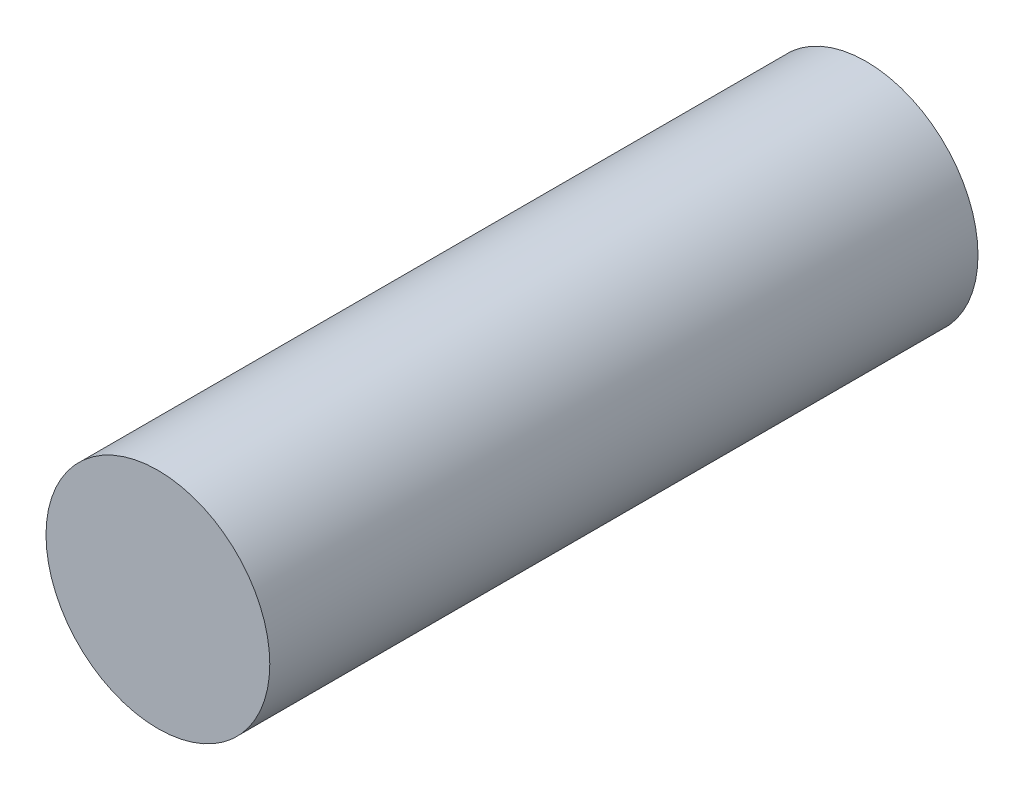
ISO-10303-21;
HEADER;
FILE_DESCRIPTION(('STEP AP214'),'2;1');
FILE_NAME('part.step','',(''),(''),'','','');
FILE_SCHEMA(('AUTOMOTIVE_DESIGN { 1 0 10303 214 1 1 1 1 }'));
ENDSEC;
DATA;
#1=APPLICATION_CONTEXT('core data for automotive mechanical design processes');
#2=APPLICATION_PROTOCOL_DEFINITION('international standard','automotive_design',2000,#1);
#3=PRODUCT_CONTEXT('',#1,'mechanical');
#4=PRODUCT('Part','Part','',(#3));
#5=PRODUCT_RELATED_PRODUCT_CATEGORY('part','',(#4));
#6=PRODUCT_DEFINITION_FORMATION('','',#4);
#7=PRODUCT_DEFINITION_CONTEXT('part definition',#1,'design');
#8=PRODUCT_DEFINITION('design','',#6,#7);
#9=PRODUCT_DEFINITION_SHAPE('','',#8);
#10=(LENGTH_UNIT() NAMED_UNIT(*) SI_UNIT(.MILLI.,.METRE.));
#11=(NAMED_UNIT(*) PLANE_ANGLE_UNIT() SI_UNIT($,.RADIAN.));
#12=(NAMED_UNIT(*) SI_UNIT($,.STERADIAN.) SOLID_ANGLE_UNIT());
#13=UNCERTAINTY_MEASURE_WITH_UNIT(LENGTH_MEASURE(1.E-05),#10,'distance_accuracy_value','');
#14=(GEOMETRIC_REPRESENTATION_CONTEXT(3) GLOBAL_UNCERTAINTY_ASSIGNED_CONTEXT((#13)) GLOBAL_UNIT_ASSIGNED_CONTEXT((#10,
#11,#12)) REPRESENTATION_CONTEXT('',''));
#15=CARTESIAN_POINT('',(0.,0.,0.));
#16=DIRECTION('',(0.,0.,1.));
#17=DIRECTION('',(1.,0.,0.));
#18=AXIS2_PLACEMENT_3D('',#15,#16,#17);
#19=CARTESIAN_POINT('',(0.,0.,50.));
#20=DIRECTION('',(0.,0.,-1.));
#21=DIRECTION('',(-1.,0.,0.));
#22=AXIS2_PLACEMENT_3D('',#19,#20,#21);
#23=CYLINDRICAL_SURFACE('',#22,7.9);
#24=CARTESIAN_POINT('',(0.,0.,50.));
#25=DIRECTION('',(0.,0.,1.));
#26=DIRECTION('',(1.,0.,0.));
#27=AXIS2_PLACEMENT_3D('',#24,#25,#26);
#28=CIRCLE('',#27,7.9);
#29=CARTESIAN_POINT('',(7.9,0.,50.));
#30=VERTEX_POINT('',#29);
#31=EDGE_CURVE('E10',#30,#30,#28,.T.);
#32=ORIENTED_EDGE('',*,*,#31,.F.);
#33=EDGE_LOOP('',(#32));
#34=FACE_BOUND('',#33,.T.);
#35=CARTESIAN_POINT('',(0.,0.,0.));
#36=DIRECTION('',(0.,0.,1.));
#37=DIRECTION('',(1.,0.,0.));
#38=AXIS2_PLACEMENT_3D('',#35,#36,#37);
#39=CIRCLE('',#38,7.9);
#40=CARTESIAN_POINT('',(7.9,0.,0.));
#41=VERTEX_POINT('',#40);
#42=EDGE_CURVE('E34',#41,#41,#39,.T.);
#43=ORIENTED_EDGE('',*,*,#42,.T.);
#44=EDGE_LOOP('',(#43));
#45=FACE_BOUND('',#44,.T.);
#46=ADVANCED_FACE('F31',(#34,#45),#23,.T.);
#47=CARTESIAN_POINT('',(0.,0.,50.));
#48=DIRECTION('',(0.,0.,1.));
#49=DIRECTION('',(1.,0.,0.));
#50=AXIS2_PLACEMENT_3D('',#47,#48,#49);
#51=PLANE('',#50);
#52=ORIENTED_EDGE('',*,*,#31,.T.);
#53=EDGE_LOOP('',(#52));
#54=FACE_BOUND('',#53,.T.);
#55=ADVANCED_FACE('F46',(#54),#51,.T.);
#56=CARTESIAN_POINT('',(0.,0.,0.));
#57=DIRECTION('',(0.,0.,1.));
#58=DIRECTION('',(1.,0.,0.));
#59=AXIS2_PLACEMENT_3D('',#56,#57,#58);
#60=PLANE('',#59);
#61=ORIENTED_EDGE('',*,*,#42,.F.);
#62=EDGE_LOOP('',(#61));
#63=FACE_BOUND('',#62,.T.);
#64=ADVANCED_FACE('F44',(#63),#60,.F.);
#65=CLOSED_SHELL('',(#46,#55,#64));
#66=MANIFOLD_SOLID_BREP('B2',#65);
#67=ADVANCED_BREP_SHAPE_REPRESENTATION('',(#18,#66),#14);
#68=SHAPE_DEFINITION_REPRESENTATION(#9,#67);
ENDSEC;
END-ISO-10303-21;
